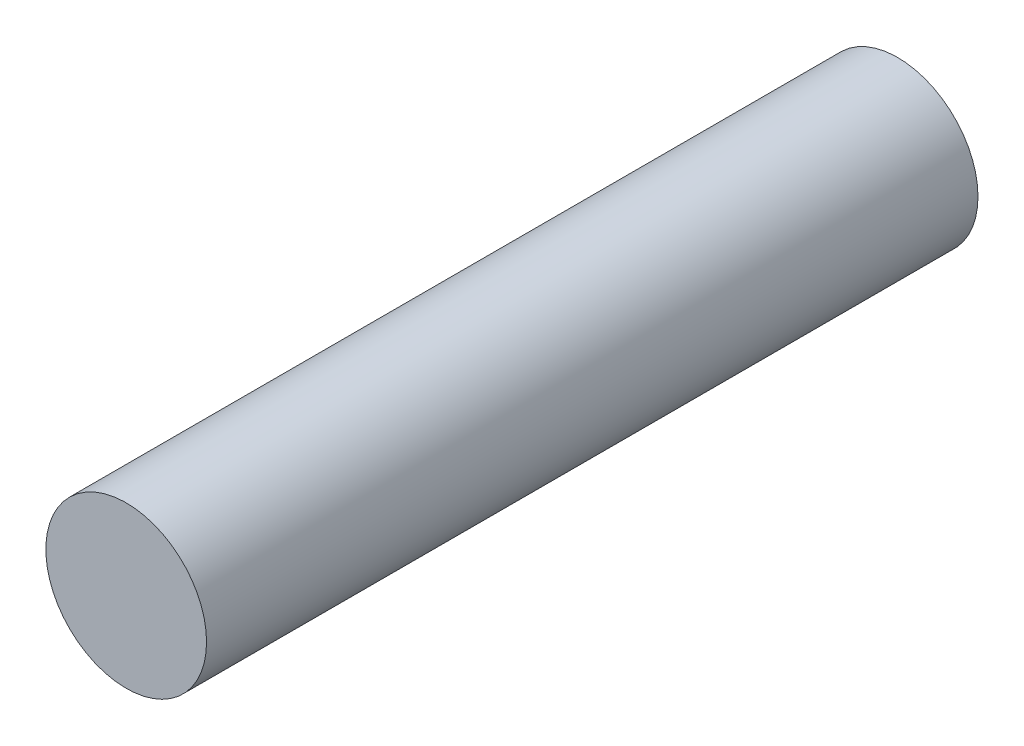
ISO-10303-21;
HEADER;
FILE_DESCRIPTION(('STEP AP214'),'2;1');
FILE_NAME('part.step','',(''),(''),'','','');
FILE_SCHEMA(('AUTOMOTIVE_DESIGN { 1 0 10303 214 1 1 1 1 }'));
ENDSEC;
DATA;
#1=APPLICATION_CONTEXT('core data for automotive mechanical design processes');
#2=APPLICATION_PROTOCOL_DEFINITION('international standard','automotive_design',2000,#1);
#3=PRODUCT_CONTEXT('',#1,'mechanical');
#4=PRODUCT('Part','Part','',(#3));
#5=PRODUCT_RELATED_PRODUCT_CATEGORY('part','',(#4));
#6=PRODUCT_DEFINITION_FORMATION('','',#4);
#7=PRODUCT_DEFINITION_CONTEXT('part definition',#1,'design');
#8=PRODUCT_DEFINITION('design','',#6,#7);
#9=PRODUCT_DEFINITION_SHAPE('','',#8);
#10=(LENGTH_UNIT() NAMED_UNIT(*) SI_UNIT(.MILLI.,.METRE.));
#11=(NAMED_UNIT(*) PLANE_ANGLE_UNIT() SI_UNIT($,.RADIAN.));
#12=(NAMED_UNIT(*) SI_UNIT($,.STERADIAN.) SOLID_ANGLE_UNIT());
#13=UNCERTAINTY_MEASURE_WITH_UNIT(LENGTH_MEASURE(1.E-05),#10,'distance_accuracy_value','');
#14=(GEOMETRIC_REPRESENTATION_CONTEXT(3) GLOBAL_UNCERTAINTY_ASSIGNED_CONTEXT((#13)) GLOBAL_UNIT_ASSIGNED_CONTEXT((#10,
#11,#12)) REPRESENTATION_CONTEXT('',''));
#15=CARTESIAN_POINT('',(0.,0.,0.));
#16=DIRECTION('',(0.,0.,1.));
#17=DIRECTION('',(1.,0.,0.));
#18=AXIS2_PLACEMENT_3D('',#15,#16,#17);
#19=CARTESIAN_POINT('',(0.,0.,12.));
#20=DIRECTION('',(0.,0.,-1.));
#21=DIRECTION('',(-1.,0.,0.));
#22=AXIS2_PLACEMENT_3D('',#19,#20,#21);
#23=CYLINDRICAL_SURFACE('',#22,1.25);
#24=CARTESIAN_POINT('',(0.,0.,12.));
#25=DIRECTION('',(0.,0.,1.));
#26=DIRECTION('',(1.,0.,0.));
#27=AXIS2_PLACEMENT_3D('',#24,#25,#26);
#28=CIRCLE('',#27,1.25);
#29=CARTESIAN_POINT('',(1.25,0.,12.));
#30=VERTEX_POINT('',#29);
#31=EDGE_CURVE('E10',#30,#30,#28,.T.);
#32=ORIENTED_EDGE('',*,*,#31,.F.);
#33=EDGE_LOOP('',(#32));
#34=FACE_BOUND('',#33,.T.);
#35=CARTESIAN_POINT('',(0.,0.,0.));
#36=DIRECTION('',(0.,0.,1.));
#37=DIRECTION('',(1.,0.,0.));
#38=AXIS2_PLACEMENT_3D('',#35,#36,#37);
#39=CIRCLE('',#38,1.25);
#40=CARTESIAN_POINT('',(1.25,0.,0.));
#41=VERTEX_POINT('',#40);
#42=EDGE_CURVE('E37',#41,#41,#39,.T.);
#43=ORIENTED_EDGE('',*,*,#42,.T.);
#44=EDGE_LOOP('',(#43));
#45=FACE_BOUND('',#44,.T.);
#46=ADVANCED_FACE('F34',(#34,#45),#23,.T.);
#47=CARTESIAN_POINT('',(0.,0.,12.));
#48=DIRECTION('',(0.,0.,1.));
#49=DIRECTION('',(1.,0.,0.));
#50=AXIS2_PLACEMENT_3D('',#47,#48,#49);
#51=PLANE('',#50);
#52=ORIENTED_EDGE('',*,*,#31,.T.);
#53=EDGE_LOOP('',(#52));
#54=FACE_BOUND('',#53,.T.);
#55=ADVANCED_FACE('F49',(#54),#51,.T.);
#56=CARTESIAN_POINT('',(0.,0.,0.));
#57=DIRECTION('',(0.,0.,1.));
#58=DIRECTION('',(1.,0.,0.));
#59=AXIS2_PLACEMENT_3D('',#56,#57,#58);
#60=PLANE('',#59);
#61=ORIENTED_EDGE('',*,*,#42,.F.);
#62=EDGE_LOOP('',(#61));
#63=FACE_BOUND('',#62,.T.);
#64=ADVANCED_FACE('F47',(#63),#60,.F.);
#65=CLOSED_SHELL('',(#46,#55,#64));
#66=MANIFOLD_SOLID_BREP('B2',#65);
#67=ADVANCED_BREP_SHAPE_REPRESENTATION('',(#18,#66),#14);
#68=SHAPE_DEFINITION_REPRESENTATION(#9,#67);
ENDSEC;
END-ISO-10303-21;
